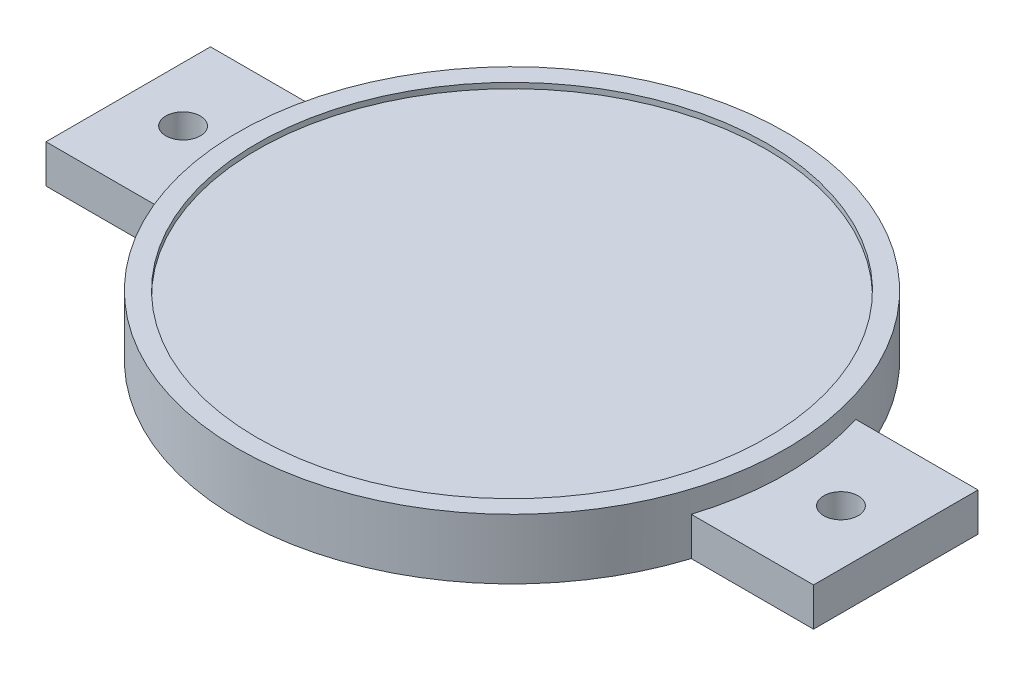
ISO-10303-21;
HEADER;
FILE_DESCRIPTION(('STEP AP214'),'2;1');
FILE_NAME('part.step','',(''),(''),'','','');
FILE_SCHEMA(('AUTOMOTIVE_DESIGN { 1 0 10303 214 1 1 1 1 }'));
ENDSEC;
DATA;
#1=APPLICATION_CONTEXT('core data for automotive mechanical design processes');
#2=APPLICATION_PROTOCOL_DEFINITION('international standard','automotive_design',2000,#1);
#3=PRODUCT_CONTEXT('',#1,'mechanical');
#4=PRODUCT('Part','Part','',(#3));
#5=PRODUCT_RELATED_PRODUCT_CATEGORY('part','',(#4));
#6=PRODUCT_DEFINITION_FORMATION('','',#4);
#7=PRODUCT_DEFINITION_CONTEXT('part definition',#1,'design');
#8=PRODUCT_DEFINITION('design','',#6,#7);
#9=PRODUCT_DEFINITION_SHAPE('','',#8);
#10=(LENGTH_UNIT() NAMED_UNIT(*) SI_UNIT(.MILLI.,.METRE.));
#11=(NAMED_UNIT(*) PLANE_ANGLE_UNIT() SI_UNIT($,.RADIAN.));
#12=(NAMED_UNIT(*) SI_UNIT($,.STERADIAN.) SOLID_ANGLE_UNIT());
#13=UNCERTAINTY_MEASURE_WITH_UNIT(LENGTH_MEASURE(1.E-05),#10,'distance_accuracy_value','');
#14=(GEOMETRIC_REPRESENTATION_CONTEXT(3) GLOBAL_UNCERTAINTY_ASSIGNED_CONTEXT((#13)) GLOBAL_UNIT_ASSIGNED_CONTEXT((#10,
#11,#12)) REPRESENTATION_CONTEXT('',''));
#15=CARTESIAN_POINT('',(0.,0.,0.));
#16=DIRECTION('',(0.,0.,1.));
#17=DIRECTION('',(1.,0.,0.));
#18=AXIS2_PLACEMENT_3D('',#15,#16,#17);
#19=CARTESIAN_POINT('',(0.,10.,0.));
#20=DIRECTION('',(0.,-1.,0.));
#21=DIRECTION('',(0.,0.,-1.));
#22=AXIS2_PLACEMENT_3D('',#19,#20,#21);
#23=CYLINDRICAL_SURFACE('',#22,50.);
#24=CARTESIAN_POINT('',(0.,11.,0.));
#25=DIRECTION('',(0.,1.,0.));
#26=DIRECTION('',(0.,0.,1.));
#27=AXIS2_PLACEMENT_3D('',#24,#25,#26);
#28=CIRCLE('',#27,50.);
#29=CARTESIAN_POINT('',(0.,11.,50.));
#30=VERTEX_POINT('',#29);
#31=EDGE_CURVE('E209',#30,#30,#28,.T.);
#32=ORIENTED_EDGE('',*,*,#31,.F.);
#33=EDGE_LOOP('',(#32));
#34=FACE_BOUND('',#33,.T.);
#35=DIRECTION('',(0.,-1.,0.));
#36=VECTOR('',#35,1.);
#37=CARTESIAN_POINT('',(47.6969600708473,7.,15.));
#38=LINE('',#37,#36);
#39=CARTESIAN_POINT('',(47.6969600708473,7.,15.));
#40=VERTEX_POINT('',#39);
#41=CARTESIAN_POINT('',(47.6969600708473,0.,15.));
#42=VERTEX_POINT('',#41);
#43=EDGE_CURVE('E54',#40,#42,#38,.T.);
#44=ORIENTED_EDGE('',*,*,#43,.F.);
#45=CARTESIAN_POINT('',(0.,7.,0.));
#46=DIRECTION('',(0.,-1.,0.));
#47=DIRECTION('',(0.,0.,1.));
#48=AXIS2_PLACEMENT_3D('',#45,#46,#47);
#49=CIRCLE('',#48,50.);
#50=CARTESIAN_POINT('',(47.6969600708473,7.,-15.));
#51=VERTEX_POINT('',#50);
#52=EDGE_CURVE('E59',#51,#40,#49,.T.);
#53=ORIENTED_EDGE('',*,*,#52,.F.);
#54=DIRECTION('',(0.,-1.,0.));
#55=VECTOR('',#54,1.);
#56=CARTESIAN_POINT('',(47.6969600708473,7.,-15.));
#57=LINE('',#56,#55);
#58=CARTESIAN_POINT('',(47.6969600708473,0.,-15.));
#59=VERTEX_POINT('',#58);
#60=EDGE_CURVE('E129',#51,#59,#57,.T.);
#61=ORIENTED_EDGE('',*,*,#60,.T.);
#62=CARTESIAN_POINT('',(0.,0.,0.));
#63=DIRECTION('',(0.,1.,0.));
#64=DIRECTION('',(0.,0.,1.));
#65=AXIS2_PLACEMENT_3D('',#62,#63,#64);
#66=CIRCLE('',#65,50.);
#67=CARTESIAN_POINT('',(-47.6969600708473,0.,-15.));
#68=VERTEX_POINT('',#67);
#69=EDGE_CURVE('E212',#59,#68,#66,.T.);
#70=ORIENTED_EDGE('',*,*,#69,.T.);
#71=DIRECTION('',(0.,-1.,0.));
#72=VECTOR('',#71,1.);
#73=CARTESIAN_POINT('',(-47.6969600708473,7.,-15.));
#74=LINE('',#73,#72);
#75=CARTESIAN_POINT('',(-47.6969600708473,7.,-15.));
#76=VERTEX_POINT('',#75);
#77=EDGE_CURVE('E193',#76,#68,#74,.T.);
#78=ORIENTED_EDGE('',*,*,#77,.F.);
#79=CARTESIAN_POINT('',(0.,7.,0.));
#80=DIRECTION('',(0.,-1.,0.));
#81=DIRECTION('',(0.,0.,-1.));
#82=AXIS2_PLACEMENT_3D('',#79,#80,#81);
#83=CIRCLE('',#82,50.);
#84=CARTESIAN_POINT('',(-47.6969600708473,7.,15.));
#85=VERTEX_POINT('',#84);
#86=EDGE_CURVE('E158',#85,#76,#83,.T.);
#87=ORIENTED_EDGE('',*,*,#86,.F.);
#88=DIRECTION('',(0.,-1.,0.));
#89=VECTOR('',#88,1.);
#90=CARTESIAN_POINT('',(-47.6969600708473,7.,15.));
#91=LINE('',#90,#89);
#92=CARTESIAN_POINT('',(-47.6969600708473,0.,15.));
#93=VERTEX_POINT('',#92);
#94=EDGE_CURVE('E173',#85,#93,#91,.T.);
#95=ORIENTED_EDGE('',*,*,#94,.T.);
#96=EDGE_CURVE('E47',#93,#42,#66,.T.);
#97=ORIENTED_EDGE('',*,*,#96,.T.);
#98=EDGE_LOOP('',(#44,#53,#61,#70,#78,#87,#95,#97));
#99=FACE_BOUND('',#98,.T.);
#100=ADVANCED_FACE('F39',(#34,#99),#23,.T.);
#101=CARTESIAN_POINT('',(0.,0.,0.));
#102=DIRECTION('',(0.,1.,0.));
#103=DIRECTION('',(0.,0.,1.));
#104=AXIS2_PLACEMENT_3D('',#101,#102,#103);
#105=PLANE('',#104);
#106=CARTESIAN_POINT('',(0.,0.,0.));
#107=DIRECTION('',(0.,-1.,0.));
#108=DIRECTION('',(0.,0.,-1.));
#109=AXIS2_PLACEMENT_3D('',#106,#107,#108);
#110=CIRCLE('',#109,47.);
#111=CARTESIAN_POINT('',(0.,0.,-47.));
#112=VERTEX_POINT('',#111);
#113=EDGE_CURVE('E197',#112,#112,#110,.T.);
#114=ORIENTED_EDGE('',*,*,#113,.F.);
#115=EDGE_LOOP('',(#114));
#116=FACE_BOUND('',#115,.T.);
#117=ORIENTED_EDGE('',*,*,#96,.F.);
#118=DIRECTION('',(1.,0.,0.));
#119=VECTOR('',#118,1.);
#120=CARTESIAN_POINT('',(-47.6969600708473,0.,15.));
#121=LINE('',#120,#119);
#122=CARTESIAN_POINT('',(-70.,0.,15.));
#123=VERTEX_POINT('',#122);
#124=EDGE_CURVE('E163',#123,#93,#121,.T.);
#125=ORIENTED_EDGE('',*,*,#124,.F.);
#126=DIRECTION('',(0.,0.,1.));
#127=VECTOR('',#126,1.);
#128=CARTESIAN_POINT('',(-70.,0.,-15.));
#129=LINE('',#128,#127);
#130=CARTESIAN_POINT('',(-70.,0.,-15.));
#131=VERTEX_POINT('',#130);
#132=EDGE_CURVE('E176',#131,#123,#129,.T.);
#133=ORIENTED_EDGE('',*,*,#132,.F.);
#134=DIRECTION('',(-1.,0.,0.));
#135=VECTOR('',#134,1.);
#136=CARTESIAN_POINT('',(-47.6969600708473,0.,-15.));
#137=LINE('',#136,#135);
#138=EDGE_CURVE('E154',#68,#131,#137,.T.);
#139=ORIENTED_EDGE('',*,*,#138,.F.);
#140=ORIENTED_EDGE('',*,*,#69,.F.);
#141=DIRECTION('',(-1.,0.,0.));
#142=VECTOR('',#141,1.);
#143=CARTESIAN_POINT('',(47.6969600708473,0.,-15.));
#144=LINE('',#143,#142);
#145=CARTESIAN_POINT('',(70.,0.,-15.));
#146=VERTEX_POINT('',#145);
#147=EDGE_CURVE('E139',#146,#59,#144,.T.);
#148=ORIENTED_EDGE('',*,*,#147,.F.);
#149=DIRECTION('',(0.,0.,-1.));
#150=VECTOR('',#149,1.);
#151=CARTESIAN_POINT('',(70.,0.,-15.));
#152=LINE('',#151,#150);
#153=CARTESIAN_POINT('',(70.,0.,15.));
#154=VERTEX_POINT('',#153);
#155=EDGE_CURVE('E135',#154,#146,#152,.T.);
#156=ORIENTED_EDGE('',*,*,#155,.F.);
#157=DIRECTION('',(1.,0.,0.));
#158=VECTOR('',#157,1.);
#159=CARTESIAN_POINT('',(47.6969600708473,0.,15.));
#160=LINE('',#159,#158);
#161=EDGE_CURVE('E116',#42,#154,#160,.T.);
#162=ORIENTED_EDGE('',*,*,#161,.F.);
#163=EDGE_LOOP('',(#117,#125,#133,#139,#140,#148,#156,#162));
#164=FACE_BOUND('',#163,.T.);
#165=CARTESIAN_POINT('',(-60.,0.,0.));
#166=DIRECTION('',(0.,1.,0.));
#167=DIRECTION('',(0.,0.,1.));
#168=AXIS2_PLACEMENT_3D('',#165,#166,#167);
#169=CIRCLE('',#168,3.15);
#170=CARTESIAN_POINT('',(-60.,0.,3.15));
#171=VERTEX_POINT('',#170);
#172=EDGE_CURVE('E149',#171,#171,#169,.T.);
#173=ORIENTED_EDGE('',*,*,#172,.T.);
#174=EDGE_LOOP('',(#173));
#175=FACE_BOUND('',#174,.T.);
#176=CARTESIAN_POINT('',(60.,0.,0.));
#177=DIRECTION('',(0.,1.,0.));
#178=DIRECTION('',(0.,0.,-1.));
#179=AXIS2_PLACEMENT_3D('',#176,#177,#178);
#180=CIRCLE('',#179,3.15);
#181=CARTESIAN_POINT('',(60.,0.,-3.15));
#182=VERTEX_POINT('',#181);
#183=EDGE_CURVE('E410',#182,#182,#180,.T.);
#184=ORIENTED_EDGE('',*,*,#183,.T.);
#185=EDGE_LOOP('',(#184));
#186=FACE_BOUND('',#185,.T.);
#187=ADVANCED_FACE('F221',(#116,#164,#175,#186),#105,.F.);
#188=CARTESIAN_POINT('',(0.,11.,0.));
#189=DIRECTION('',(0.,1.,0.));
#190=DIRECTION('',(0.,0.,1.));
#191=AXIS2_PLACEMENT_3D('',#188,#189,#190);
#192=PLANE('',#191);
#193=ORIENTED_EDGE('',*,*,#31,.T.);
#194=EDGE_LOOP('',(#193));
#195=FACE_BOUND('',#194,.T.);
#196=CARTESIAN_POINT('',(0.,11.,0.));
#197=DIRECTION('',(0.,1.,0.));
#198=DIRECTION('',(0.,0.,1.));
#199=AXIS2_PLACEMENT_3D('',#196,#197,#198);
#200=CIRCLE('',#199,46.5);
#201=CARTESIAN_POINT('',(0.,11.,46.5));
#202=VERTEX_POINT('',#201);
#203=EDGE_CURVE('E202',#202,#202,#200,.T.);
#204=ORIENTED_EDGE('',*,*,#203,.F.);
#205=EDGE_LOOP('',(#204));
#206=FACE_BOUND('',#205,.T.);
#207=ADVANCED_FACE('F254',(#195,#206),#192,.T.);
#208=CARTESIAN_POINT('',(0.,11.,0.));
#209=DIRECTION('',(0.,-1.,0.));
#210=DIRECTION('',(0.,0.,-1.));
#211=AXIS2_PLACEMENT_3D('',#208,#209,#210);
#212=CYLINDRICAL_SURFACE('',#211,46.5);
#213=ORIENTED_EDGE('',*,*,#203,.T.);
#214=EDGE_LOOP('',(#213));
#215=FACE_BOUND('',#214,.T.);
#216=CARTESIAN_POINT('',(0.,10.,0.));
#217=DIRECTION('',(0.,1.,0.));
#218=DIRECTION('',(0.,0.,1.));
#219=AXIS2_PLACEMENT_3D('',#216,#217,#218);
#220=CIRCLE('',#219,46.5);
#221=CARTESIAN_POINT('',(0.,10.,46.5));
#222=VERTEX_POINT('',#221);
#223=EDGE_CURVE('E11',#222,#222,#220,.F.);
#224=ORIENTED_EDGE('',*,*,#223,.T.);
#225=EDGE_LOOP('',(#224));
#226=FACE_BOUND('',#225,.T.);
#227=ADVANCED_FACE('F260',(#215,#226),#212,.F.);
#228=CARTESIAN_POINT('',(0.,10.,0.));
#229=DIRECTION('',(0.,1.,0.));
#230=DIRECTION('',(0.,0.,1.));
#231=AXIS2_PLACEMENT_3D('',#228,#229,#230);
#232=PLANE('',#231);
#233=ORIENTED_EDGE('',*,*,#223,.F.);
#234=EDGE_LOOP('',(#233));
#235=FACE_BOUND('',#234,.T.);
#236=ADVANCED_FACE('F266',(#235),#232,.T.);
#237=CARTESIAN_POINT('',(0.,7.,0.));
#238=DIRECTION('',(0.,-1.,0.));
#239=DIRECTION('',(0.,0.,-1.));
#240=AXIS2_PLACEMENT_3D('',#237,#238,#239);
#241=CYLINDRICAL_SURFACE('',#240,47.);
#242=CARTESIAN_POINT('',(0.,7.,0.));
#243=DIRECTION('',(0.,-1.,0.));
#244=DIRECTION('',(0.,0.,-1.));
#245=AXIS2_PLACEMENT_3D('',#242,#243,#244);
#246=CIRCLE('',#245,47.);
#247=CARTESIAN_POINT('',(0.,7.,-47.));
#248=VERTEX_POINT('',#247);
#249=EDGE_CURVE('E198',#248,#248,#246,.T.);
#250=ORIENTED_EDGE('',*,*,#249,.F.);
#251=EDGE_LOOP('',(#250));
#252=FACE_BOUND('',#251,.T.);
#253=ORIENTED_EDGE('',*,*,#113,.T.);
#254=EDGE_LOOP('',(#253));
#255=FACE_BOUND('',#254,.T.);
#256=ADVANCED_FACE('F271',(#252,#255),#241,.F.);
#257=CARTESIAN_POINT('',(0.,7.,0.));
#258=DIRECTION('',(0.,-1.,0.));
#259=DIRECTION('',(0.,0.,-1.));
#260=AXIS2_PLACEMENT_3D('',#257,#258,#259);
#261=PLANE('',#260);
#262=ORIENTED_EDGE('',*,*,#249,.T.);
#263=EDGE_LOOP('',(#262));
#264=FACE_BOUND('',#263,.T.);
#265=ADVANCED_FACE('F276',(#264),#261,.T.);
#266=CARTESIAN_POINT('',(0.,7.,0.));
#267=DIRECTION('',(0.,-1.,0.));
#268=DIRECTION('',(0.,0.,-1.));
#269=AXIS2_PLACEMENT_3D('',#266,#267,#268);
#270=PLANE('',#269);
#271=ORIENTED_EDGE('',*,*,#86,.T.);
#272=DIRECTION('',(-1.,0.,0.));
#273=VECTOR('',#272,1.);
#274=CARTESIAN_POINT('',(-47.6969600708473,7.,-15.));
#275=LINE('',#274,#273);
#276=CARTESIAN_POINT('',(-70.,7.,-15.));
#277=VERTEX_POINT('',#276);
#278=EDGE_CURVE('E162',#76,#277,#275,.T.);
#279=ORIENTED_EDGE('',*,*,#278,.T.);
#280=DIRECTION('',(0.,0.,1.));
#281=VECTOR('',#280,1.);
#282=CARTESIAN_POINT('',(-70.,7.,-15.));
#283=LINE('',#282,#281);
#284=CARTESIAN_POINT('',(-70.,7.,15.));
#285=VERTEX_POINT('',#284);
#286=EDGE_CURVE('E166',#277,#285,#283,.T.);
#287=ORIENTED_EDGE('',*,*,#286,.T.);
#288=DIRECTION('',(1.,0.,0.));
#289=VECTOR('',#288,1.);
#290=CARTESIAN_POINT('',(-47.6969600708473,7.,15.));
#291=LINE('',#290,#289);
#292=EDGE_CURVE('E169',#285,#85,#291,.T.);
#293=ORIENTED_EDGE('',*,*,#292,.T.);
#294=EDGE_LOOP('',(#271,#279,#287,#293));
#295=FACE_BOUND('',#294,.T.);
#296=CARTESIAN_POINT('',(-60.,7.,0.));
#297=DIRECTION('',(0.,1.,0.));
#298=DIRECTION('',(0.,0.,1.));
#299=AXIS2_PLACEMENT_3D('',#296,#297,#298);
#300=CIRCLE('',#299,3.15);
#301=CARTESIAN_POINT('',(-60.,7.,3.15));
#302=VERTEX_POINT('',#301);
#303=EDGE_CURVE('E150',#302,#302,#300,.T.);
#304=ORIENTED_EDGE('',*,*,#303,.F.);
#305=EDGE_LOOP('',(#304));
#306=FACE_BOUND('',#305,.T.);
#307=ADVANCED_FACE('F229',(#295,#306),#270,.F.);
#308=CARTESIAN_POINT('',(-47.6969600708473,7.,-15.));
#309=DIRECTION('',(0.,0.,1.));
#310=DIRECTION('',(1.,0.,0.));
#311=AXIS2_PLACEMENT_3D('',#308,#309,#310);
#312=PLANE('',#311);
#313=ORIENTED_EDGE('',*,*,#138,.T.);
#314=DIRECTION('',(0.,-1.,0.));
#315=VECTOR('',#314,1.);
#316=CARTESIAN_POINT('',(-70.,7.,-15.));
#317=LINE('',#316,#315);
#318=EDGE_CURVE('E189',#277,#131,#317,.T.);
#319=ORIENTED_EDGE('',*,*,#318,.F.);
#320=ORIENTED_EDGE('',*,*,#278,.F.);
#321=ORIENTED_EDGE('',*,*,#77,.T.);
#322=EDGE_LOOP('',(#313,#319,#320,#321));
#323=FACE_BOUND('',#322,.T.);
#324=ADVANCED_FACE('F226',(#323),#312,.F.);
#325=CARTESIAN_POINT('',(-70.,7.,-15.));
#326=DIRECTION('',(1.,0.,0.));
#327=DIRECTION('',(0.,0.,-1.));
#328=AXIS2_PLACEMENT_3D('',#325,#326,#327);
#329=PLANE('',#328);
#330=ORIENTED_EDGE('',*,*,#132,.T.);
#331=DIRECTION('',(0.,-1.,0.));
#332=VECTOR('',#331,1.);
#333=CARTESIAN_POINT('',(-70.,7.,15.));
#334=LINE('',#333,#332);
#335=EDGE_CURVE('E185',#285,#123,#334,.T.);
#336=ORIENTED_EDGE('',*,*,#335,.F.);
#337=ORIENTED_EDGE('',*,*,#286,.F.);
#338=ORIENTED_EDGE('',*,*,#318,.T.);
#339=EDGE_LOOP('',(#330,#336,#337,#338));
#340=FACE_BOUND('',#339,.T.);
#341=ADVANCED_FACE('F285',(#340),#329,.F.);
#342=CARTESIAN_POINT('',(-47.6969600708473,7.,15.));
#343=DIRECTION('',(0.,0.,-1.));
#344=DIRECTION('',(-1.,0.,0.));
#345=AXIS2_PLACEMENT_3D('',#342,#343,#344);
#346=PLANE('',#345);
#347=ORIENTED_EDGE('',*,*,#124,.T.);
#348=ORIENTED_EDGE('',*,*,#94,.F.);
#349=ORIENTED_EDGE('',*,*,#292,.F.);
#350=ORIENTED_EDGE('',*,*,#335,.T.);
#351=EDGE_LOOP('',(#347,#348,#349,#350));
#352=FACE_BOUND('',#351,.T.);
#353=ADVANCED_FACE('F234',(#352),#346,.F.);
#354=CARTESIAN_POINT('',(-60.,7.,0.));
#355=DIRECTION('',(0.,-1.,0.));
#356=DIRECTION('',(0.,0.,-1.));
#357=AXIS2_PLACEMENT_3D('',#354,#355,#356);
#358=CYLINDRICAL_SURFACE('',#357,3.15);
#359=ORIENTED_EDGE('',*,*,#303,.T.);
#360=EDGE_LOOP('',(#359));
#361=FACE_BOUND('',#360,.T.);
#362=ORIENTED_EDGE('',*,*,#172,.F.);
#363=EDGE_LOOP('',(#362));
#364=FACE_BOUND('',#363,.T.);
#365=ADVANCED_FACE('F291',(#361,#364),#358,.F.);
#366=CARTESIAN_POINT('',(0.,7.,0.));
#367=DIRECTION('',(0.,1.,0.));
#368=DIRECTION('',(0.,0.,1.));
#369=AXIS2_PLACEMENT_3D('',#366,#367,#368);
#370=PLANE('',#369);
#371=ORIENTED_EDGE('',*,*,#52,.T.);
#372=DIRECTION('',(1.,0.,0.));
#373=VECTOR('',#372,1.);
#374=CARTESIAN_POINT('',(47.6969600708473,7.,15.));
#375=LINE('',#374,#373);
#376=CARTESIAN_POINT('',(70.,7.,15.));
#377=VERTEX_POINT('',#376);
#378=EDGE_CURVE('E102',#40,#377,#375,.T.);
#379=ORIENTED_EDGE('',*,*,#378,.T.);
#380=DIRECTION('',(0.,0.,-1.));
#381=VECTOR('',#380,1.);
#382=CARTESIAN_POINT('',(70.,7.,-15.));
#383=LINE('',#382,#381);
#384=CARTESIAN_POINT('',(70.,7.,-15.));
#385=VERTEX_POINT('',#384);
#386=EDGE_CURVE('E107',#377,#385,#383,.T.);
#387=ORIENTED_EDGE('',*,*,#386,.T.);
#388=DIRECTION('',(-1.,0.,0.));
#389=VECTOR('',#388,1.);
#390=CARTESIAN_POINT('',(47.6969600708473,7.,-15.));
#391=LINE('',#390,#389);
#392=EDGE_CURVE('E126',#385,#51,#391,.T.);
#393=ORIENTED_EDGE('',*,*,#392,.T.);
#394=EDGE_LOOP('',(#371,#379,#387,#393));
#395=FACE_BOUND('',#394,.T.);
#396=CARTESIAN_POINT('',(60.,7.,0.));
#397=DIRECTION('',(0.,1.,0.));
#398=DIRECTION('',(0.,0.,-1.));
#399=AXIS2_PLACEMENT_3D('',#396,#397,#398);
#400=CIRCLE('',#399,3.15);
#401=CARTESIAN_POINT('',(60.,7.,-3.15));
#402=VERTEX_POINT('',#401);
#403=EDGE_CURVE('E136',#402,#402,#400,.T.);
#404=ORIENTED_EDGE('',*,*,#403,.F.);
#405=EDGE_LOOP('',(#404));
#406=FACE_BOUND('',#405,.T.);
#407=ADVANCED_FACE('F104',(#395,#406),#370,.T.);
#408=CARTESIAN_POINT('',(47.6969600708473,7.,15.));
#409=DIRECTION('',(0.,0.,-1.));
#410=DIRECTION('',(-1.,0.,0.));
#411=AXIS2_PLACEMENT_3D('',#408,#409,#410);
#412=PLANE('',#411);
#413=ORIENTED_EDGE('',*,*,#161,.T.);
#414=DIRECTION('',(0.,-1.,0.));
#415=VECTOR('',#414,1.);
#416=CARTESIAN_POINT('',(70.,7.,15.));
#417=LINE('',#416,#415);
#418=EDGE_CURVE('E113',#377,#154,#417,.T.);
#419=ORIENTED_EDGE('',*,*,#418,.F.);
#420=ORIENTED_EDGE('',*,*,#378,.F.);
#421=ORIENTED_EDGE('',*,*,#43,.T.);
#422=EDGE_LOOP('',(#413,#419,#420,#421));
#423=FACE_BOUND('',#422,.T.);
#424=ADVANCED_FACE('F114',(#423),#412,.F.);
#425=CARTESIAN_POINT('',(70.,7.,-15.));
#426=DIRECTION('',(-1.,0.,0.));
#427=DIRECTION('',(0.,0.,1.));
#428=AXIS2_PLACEMENT_3D('',#425,#426,#427);
#429=PLANE('',#428);
#430=ORIENTED_EDGE('',*,*,#155,.T.);
#431=DIRECTION('',(0.,-1.,0.));
#432=VECTOR('',#431,1.);
#433=CARTESIAN_POINT('',(70.,7.,-15.));
#434=LINE('',#433,#432);
#435=EDGE_CURVE('E120',#385,#146,#434,.T.);
#436=ORIENTED_EDGE('',*,*,#435,.F.);
#437=ORIENTED_EDGE('',*,*,#386,.F.);
#438=ORIENTED_EDGE('',*,*,#418,.T.);
#439=EDGE_LOOP('',(#430,#436,#437,#438));
#440=FACE_BOUND('',#439,.T.);
#441=ADVANCED_FACE('F122',(#440),#429,.F.);
#442=CARTESIAN_POINT('',(47.6969600708473,7.,-15.));
#443=DIRECTION('',(0.,0.,1.));
#444=DIRECTION('',(1.,0.,0.));
#445=AXIS2_PLACEMENT_3D('',#442,#443,#444);
#446=PLANE('',#445);
#447=ORIENTED_EDGE('',*,*,#147,.T.);
#448=ORIENTED_EDGE('',*,*,#60,.F.);
#449=ORIENTED_EDGE('',*,*,#392,.F.);
#450=ORIENTED_EDGE('',*,*,#435,.T.);
#451=EDGE_LOOP('',(#447,#448,#449,#450));
#452=FACE_BOUND('',#451,.T.);
#453=ADVANCED_FACE('F237',(#452),#446,.F.);
#454=CARTESIAN_POINT('',(60.,7.,0.));
#455=DIRECTION('',(0.,-1.,0.));
#456=DIRECTION('',(0.,0.,-1.));
#457=AXIS2_PLACEMENT_3D('',#454,#455,#456);
#458=CYLINDRICAL_SURFACE('',#457,3.15);
#459=ORIENTED_EDGE('',*,*,#403,.T.);
#460=EDGE_LOOP('',(#459));
#461=FACE_BOUND('',#460,.T.);
#462=ORIENTED_EDGE('',*,*,#183,.F.);
#463=EDGE_LOOP('',(#462));
#464=FACE_BOUND('',#463,.T.);
#465=ADVANCED_FACE('F239',(#461,#464),#458,.F.);
#466=CLOSED_SHELL('',(#100,#187,#207,#227,#236,#256,#265,#307,#324,#341,#353,#365,#407,#424,
#441,#453,#465));
#467=MANIFOLD_SOLID_BREP('B2',#466);
#468=ADVANCED_BREP_SHAPE_REPRESENTATION('',(#18,#467),#14);
#469=SHAPE_DEFINITION_REPRESENTATION(#9,#468);
ENDSEC;
END-ISO-10303-21;
